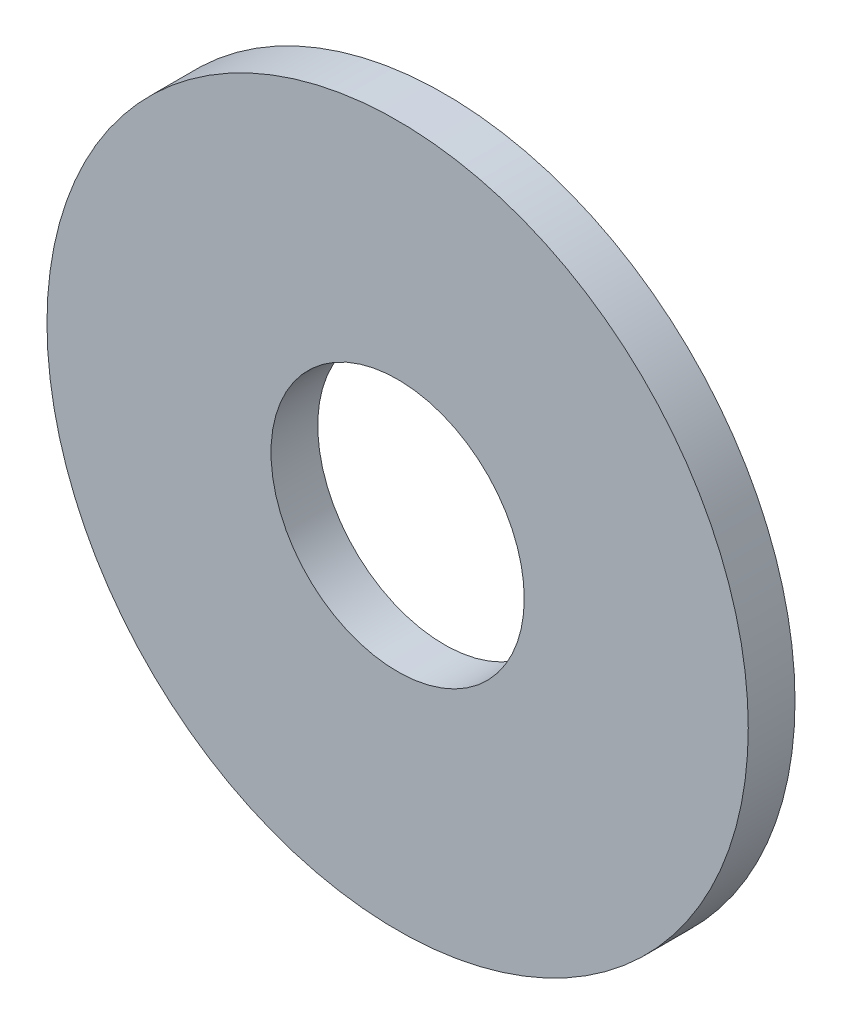
ISO-10303-21;
HEADER;
FILE_DESCRIPTION(('STEP AP214'),'2;1');
FILE_NAME('part.step','',(''),(''),'','','');
FILE_SCHEMA(('AUTOMOTIVE_DESIGN { 1 0 10303 214 1 1 1 1 }'));
ENDSEC;
DATA;
#1=APPLICATION_CONTEXT('core data for automotive mechanical design processes');
#2=APPLICATION_PROTOCOL_DEFINITION('international standard','automotive_design',2000,#1);
#3=PRODUCT_CONTEXT('',#1,'mechanical');
#4=PRODUCT('Part','Part','',(#3));
#5=PRODUCT_RELATED_PRODUCT_CATEGORY('part','',(#4));
#6=PRODUCT_DEFINITION_FORMATION('','',#4);
#7=PRODUCT_DEFINITION_CONTEXT('part definition',#1,'design');
#8=PRODUCT_DEFINITION('design','',#6,#7);
#9=PRODUCT_DEFINITION_SHAPE('','',#8);
#10=(LENGTH_UNIT() NAMED_UNIT(*) SI_UNIT(.MILLI.,.METRE.));
#11=(NAMED_UNIT(*) PLANE_ANGLE_UNIT() SI_UNIT($,.RADIAN.));
#12=(NAMED_UNIT(*) SI_UNIT($,.STERADIAN.) SOLID_ANGLE_UNIT());
#13=UNCERTAINTY_MEASURE_WITH_UNIT(LENGTH_MEASURE(1.E-05),#10,'distance_accuracy_value','');
#14=(GEOMETRIC_REPRESENTATION_CONTEXT(3) GLOBAL_UNCERTAINTY_ASSIGNED_CONTEXT((#13)) GLOBAL_UNIT_ASSIGNED_CONTEXT((#10,
#11,#12)) REPRESENTATION_CONTEXT('',''));
#15=CARTESIAN_POINT('',(0.,0.,0.));
#16=DIRECTION('',(0.,0.,1.));
#17=DIRECTION('',(1.,0.,0.));
#18=AXIS2_PLACEMENT_3D('',#15,#16,#17);
#19=CARTESIAN_POINT('',(0.,0.,1.2));
#20=DIRECTION('',(0.,0.,1.));
#21=DIRECTION('',(1.,0.,0.));
#22=AXIS2_PLACEMENT_3D('',#19,#20,#21);
#23=PLANE('',#22);
#24=CARTESIAN_POINT('',(0.,0.,1.2));
#25=DIRECTION('',(0.,0.,1.));
#26=DIRECTION('',(1.,0.,0.));
#27=AXIS2_PLACEMENT_3D('',#24,#25,#26);
#28=CIRCLE('',#27,9.);
#29=CARTESIAN_POINT('',(9.,0.,1.2));
#30=VERTEX_POINT('',#29);
#31=EDGE_CURVE('E10',#30,#30,#28,.T.);
#32=ORIENTED_EDGE('',*,*,#31,.T.);
#33=EDGE_LOOP('',(#32));
#34=FACE_BOUND('',#33,.T.);
#35=CARTESIAN_POINT('',(0.,0.,1.2));
#36=DIRECTION('',(0.,0.,1.));
#37=DIRECTION('',(1.,0.,0.));
#38=AXIS2_PLACEMENT_3D('',#35,#36,#37);
#39=CIRCLE('',#38,3.25);
#40=CARTESIAN_POINT('',(3.25,0.,1.2));
#41=VERTEX_POINT('',#40);
#42=EDGE_CURVE('E37',#41,#41,#39,.T.);
#43=ORIENTED_EDGE('',*,*,#42,.F.);
#44=EDGE_LOOP('',(#43));
#45=FACE_BOUND('',#44,.T.);
#46=ADVANCED_FACE('F26',(#34,#45),#23,.T.);
#47=CARTESIAN_POINT('',(0.,0.,0.));
#48=DIRECTION('',(0.,0.,1.));
#49=DIRECTION('',(1.,0.,0.));
#50=AXIS2_PLACEMENT_3D('',#47,#48,#49);
#51=PLANE('',#50);
#52=CARTESIAN_POINT('',(0.,0.,0.));
#53=DIRECTION('',(0.,0.,1.));
#54=DIRECTION('',(1.,0.,0.));
#55=AXIS2_PLACEMENT_3D('',#52,#53,#54);
#56=CIRCLE('',#55,9.);
#57=CARTESIAN_POINT('',(9.,0.,0.));
#58=VERTEX_POINT('',#57);
#59=EDGE_CURVE('E33',#58,#58,#56,.T.);
#60=ORIENTED_EDGE('',*,*,#59,.F.);
#61=EDGE_LOOP('',(#60));
#62=FACE_BOUND('',#61,.T.);
#63=CARTESIAN_POINT('',(0.,0.,0.));
#64=DIRECTION('',(0.,0.,1.));
#65=DIRECTION('',(1.,0.,0.));
#66=AXIS2_PLACEMENT_3D('',#63,#64,#65);
#67=CIRCLE('',#66,3.25);
#68=CARTESIAN_POINT('',(3.25,0.,0.));
#69=VERTEX_POINT('',#68);
#70=EDGE_CURVE('E41',#69,#69,#67,.T.);
#71=ORIENTED_EDGE('',*,*,#70,.T.);
#72=EDGE_LOOP('',(#71));
#73=FACE_BOUND('',#72,.T.);
#74=ADVANCED_FACE('F47',(#62,#73),#51,.F.);
#75=CARTESIAN_POINT('',(0.,0.,1.2));
#76=DIRECTION('',(0.,0.,-1.));
#77=DIRECTION('',(-1.,0.,0.));
#78=AXIS2_PLACEMENT_3D('',#75,#76,#77);
#79=CYLINDRICAL_SURFACE('',#78,9.);
#80=ORIENTED_EDGE('',*,*,#31,.F.);
#81=EDGE_LOOP('',(#80));
#82=FACE_BOUND('',#81,.T.);
#83=ORIENTED_EDGE('',*,*,#59,.T.);
#84=EDGE_LOOP('',(#83));
#85=FACE_BOUND('',#84,.T.);
#86=ADVANCED_FACE('F28',(#82,#85),#79,.T.);
#87=CARTESIAN_POINT('',(0.,0.,1.2));
#88=DIRECTION('',(0.,0.,-1.));
#89=DIRECTION('',(-1.,0.,0.));
#90=AXIS2_PLACEMENT_3D('',#87,#88,#89);
#91=CYLINDRICAL_SURFACE('',#90,3.25);
#92=ORIENTED_EDGE('',*,*,#42,.T.);
#93=EDGE_LOOP('',(#92));
#94=FACE_BOUND('',#93,.T.);
#95=ORIENTED_EDGE('',*,*,#70,.F.);
#96=EDGE_LOOP('',(#95));
#97=FACE_BOUND('',#96,.T.);
#98=ADVANCED_FACE('F49',(#94,#97),#91,.F.);
#99=CLOSED_SHELL('',(#46,#74,#86,#98));
#100=MANIFOLD_SOLID_BREP('B2',#99);
#101=ADVANCED_BREP_SHAPE_REPRESENTATION('',(#18,#100),#14);
#102=SHAPE_DEFINITION_REPRESENTATION(#9,#101);
ENDSEC;
END-ISO-10303-21;
